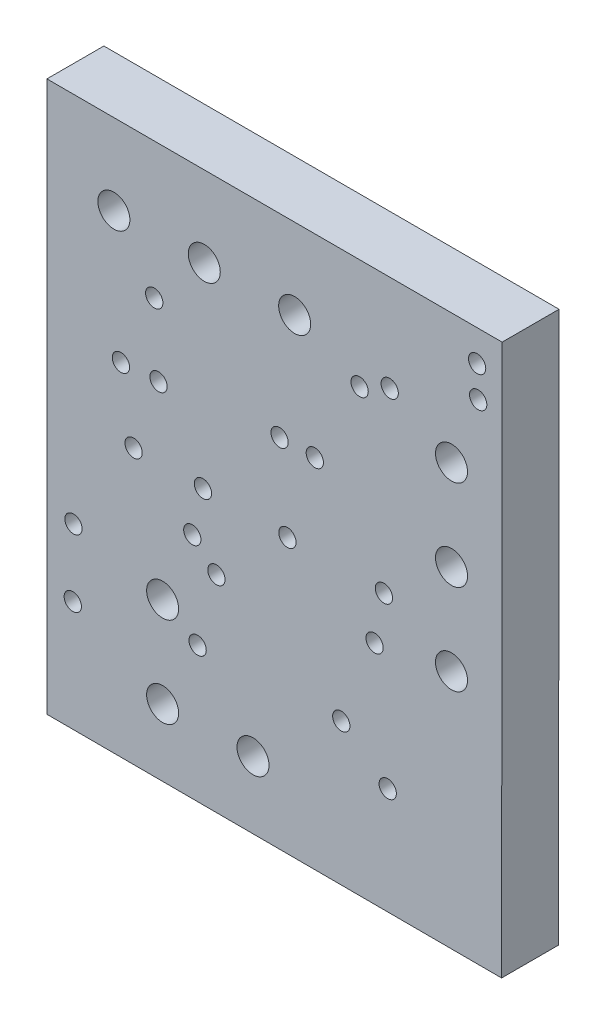
ISO-10303-21;
HEADER;
FILE_DESCRIPTION(('STEP AP214'),'2;1');
FILE_NAME('part.step','',(''),(''),'','','');
FILE_SCHEMA(('AUTOMOTIVE_DESIGN { 1 0 10303 214 1 1 1 1 }'));
ENDSEC;
DATA;
#1=APPLICATION_CONTEXT('core data for automotive mechanical design processes');
#2=APPLICATION_PROTOCOL_DEFINITION('international standard','automotive_design',2000,#1);
#3=PRODUCT_CONTEXT('',#1,'mechanical');
#4=PRODUCT('Part','Part','',(#3));
#5=PRODUCT_RELATED_PRODUCT_CATEGORY('part','',(#4));
#6=PRODUCT_DEFINITION_FORMATION('','',#4);
#7=PRODUCT_DEFINITION_CONTEXT('part definition',#1,'design');
#8=PRODUCT_DEFINITION('design','',#6,#7);
#9=PRODUCT_DEFINITION_SHAPE('','',#8);
#10=(LENGTH_UNIT() NAMED_UNIT(*) SI_UNIT(.MILLI.,.METRE.));
#11=(NAMED_UNIT(*) PLANE_ANGLE_UNIT() SI_UNIT($,.RADIAN.));
#12=(NAMED_UNIT(*) SI_UNIT($,.STERADIAN.) SOLID_ANGLE_UNIT());
#13=UNCERTAINTY_MEASURE_WITH_UNIT(LENGTH_MEASURE(1.E-05),#10,'distance_accuracy_value','');
#14=(GEOMETRIC_REPRESENTATION_CONTEXT(3) GLOBAL_UNCERTAINTY_ASSIGNED_CONTEXT((#13)) GLOBAL_UNIT_ASSIGNED_CONTEXT((#10,
#11,#12)) REPRESENTATION_CONTEXT('',''));
#15=CARTESIAN_POINT('',(0.,0.,0.));
#16=DIRECTION('',(0.,0.,1.));
#17=DIRECTION('',(1.,0.,0.));
#18=AXIS2_PLACEMENT_3D('',#15,#16,#17);
#19=CARTESIAN_POINT('',(67.869100000001,59.307866666665,0.));
#20=DIRECTION('',(0.,0.,-1.));
#21=DIRECTION('',(-1.,0.,0.));
#22=AXIS2_PLACEMENT_3D('',#19,#20,#21);
#23=PLANE('',#22);
#24=CARTESIAN_POINT('',(72.252600000002,51.530333333333,0.));
#25=DIRECTION('',(0.,0.,1.));
#26=DIRECTION('',(1.,0.,0.));
#27=AXIS2_PLACEMENT_3D('',#24,#25,#26);
#28=CIRCLE('',#27,0.243);
#29=CARTESIAN_POINT('',(72.495600000002,51.530333333333,0.));
#30=VERTEX_POINT('',#29);
#31=EDGE_CURVE('E168',#30,#30,#28,.F.);
#32=ORIENTED_EDGE('',*,*,#31,.T.);
#33=EDGE_LOOP('',(#32));
#34=FACE_BOUND('',#33,.T.);
#35=CARTESIAN_POINT('',(77.339000000002,51.527266666667,0.));
#36=DIRECTION('',(0.,0.,1.));
#37=DIRECTION('',(1.,0.,0.));
#38=AXIS2_PLACEMENT_3D('',#35,#36,#37);
#39=CIRCLE('',#38,0.243);
#40=CARTESIAN_POINT('',(77.582000000002,51.527266666667,0.));
#41=VERTEX_POINT('',#40);
#42=EDGE_CURVE('E172',#41,#41,#39,.F.);
#43=ORIENTED_EDGE('',*,*,#42,.T.);
#44=EDGE_LOOP('',(#43));
#45=FACE_BOUND('',#44,.T.);
#46=CARTESIAN_POINT('',(74.406600000002,53.850733333335,0.));
#47=DIRECTION('',(0.,0.,1.));
#48=DIRECTION('',(1.,0.,0.));
#49=AXIS2_PLACEMENT_3D('',#46,#47,#48);
#50=CIRCLE('',#49,0.243);
#51=CARTESIAN_POINT('',(74.649600000002,53.850733333335,0.));
#52=VERTEX_POINT('',#51);
#53=EDGE_CURVE('E175',#52,#52,#50,.F.);
#54=ORIENTED_EDGE('',*,*,#53,.T.);
#55=EDGE_LOOP('',(#54));
#56=FACE_BOUND('',#55,.T.);
#57=CARTESIAN_POINT('',(74.626766666668,51.527266666667,0.));
#58=DIRECTION('',(0.,0.,1.));
#59=DIRECTION('',(1.,0.,0.));
#60=AXIS2_PLACEMENT_3D('',#57,#58,#59);
#61=CIRCLE('',#60,0.243);
#62=CARTESIAN_POINT('',(74.869766666668,51.527266666667,0.));
#63=VERTEX_POINT('',#62);
#64=EDGE_CURVE('E178',#63,#63,#61,.F.);
#65=ORIENTED_EDGE('',*,*,#64,.T.);
#66=EDGE_LOOP('',(#65));
#67=FACE_BOUND('',#66,.T.);
#68=CARTESIAN_POINT('',(77.445200000002,46.822899999999,0.));
#69=DIRECTION('',(0.,0.,1.));
#70=DIRECTION('',(1.,0.,0.));
#71=AXIS2_PLACEMENT_3D('',#68,#69,#70);
#72=CIRCLE('',#71,0.243);
#73=CARTESIAN_POINT('',(77.688200000002,46.822899999999,0.));
#74=VERTEX_POINT('',#73);
#75=EDGE_CURVE('E181',#74,#74,#72,.F.);
#76=ORIENTED_EDGE('',*,*,#75,.T.);
#77=EDGE_LOOP('',(#76));
#78=FACE_BOUND('',#77,.T.);
#79=CARTESIAN_POINT('',(76.140766666669,47.815466666667,0.));
#80=DIRECTION('',(0.,0.,1.));
#81=DIRECTION('',(1.,0.,0.));
#82=AXIS2_PLACEMENT_3D('',#79,#80,#81);
#83=CIRCLE('',#82,0.243);
#84=CARTESIAN_POINT('',(76.383766666669,47.815466666667,0.));
#85=VERTEX_POINT('',#84);
#86=EDGE_CURVE('E184',#85,#85,#83,.F.);
#87=ORIENTED_EDGE('',*,*,#86,.T.);
#88=EDGE_LOOP('',(#87));
#89=FACE_BOUND('',#88,.T.);
#90=CARTESIAN_POINT('',(79.987133333333,57.558466666664,0.));
#91=DIRECTION('',(0.,0.,1.));
#92=DIRECTION('',(1.,0.,0.));
#93=AXIS2_PLACEMENT_3D('',#90,#91,#92);
#94=CIRCLE('',#93,0.243);
#95=CARTESIAN_POINT('',(80.230133333333,57.558466666664,0.));
#96=VERTEX_POINT('',#95);
#97=EDGE_CURVE('E187',#96,#96,#94,.F.);
#98=ORIENTED_EDGE('',*,*,#97,.T.);
#99=EDGE_LOOP('',(#98));
#100=FACE_BOUND('',#99,.T.);
#101=CARTESIAN_POINT('',(76.655699999998,56.210666666666,0.));
#102=DIRECTION('',(0.,0.,1.));
#103=DIRECTION('',(1.,0.,0.));
#104=AXIS2_PLACEMENT_3D('',#101,#102,#103);
#105=CIRCLE('',#104,0.243);
#106=CARTESIAN_POINT('',(76.898699999998,56.210666666666,0.));
#107=VERTEX_POINT('',#106);
#108=EDGE_CURVE('E190',#107,#107,#105,.F.);
#109=ORIENTED_EDGE('',*,*,#108,.T.);
#110=EDGE_LOOP('',(#109));
#111=FACE_BOUND('',#110,.T.);
#112=CARTESIAN_POINT('',(71.954066666668,50.257266666667,0.));
#113=DIRECTION('',(0.,0.,1.));
#114=DIRECTION('',(1.,0.,0.));
#115=AXIS2_PLACEMENT_3D('',#112,#113,#114);
#116=CIRCLE('',#115,0.243);
#117=CARTESIAN_POINT('',(72.197066666668,50.257266666667,0.));
#118=VERTEX_POINT('',#117);
#119=EDGE_CURVE('E193',#118,#118,#116,.F.);
#120=ORIENTED_EDGE('',*,*,#119,.T.);
#121=EDGE_LOOP('',(#120));
#122=FACE_BOUND('',#121,.T.);
#123=CARTESIAN_POINT('',(68.615,48.850733333335,0.));
#124=DIRECTION('',(0.,0.,1.));
#125=DIRECTION('',(1.,0.,0.));
#126=AXIS2_PLACEMENT_3D('',#123,#124,#125);
#127=CIRCLE('',#126,0.243);
#128=CARTESIAN_POINT('',(68.858,48.850733333335,0.));
#129=VERTEX_POINT('',#128);
#130=EDGE_CURVE('E196',#129,#129,#127,.F.);
#131=ORIENTED_EDGE('',*,*,#130,.T.);
#132=EDGE_LOOP('',(#131));
#133=FACE_BOUND('',#132,.T.);
#134=CARTESIAN_POINT('',(71.005299999999,53.507099999998,0.));
#135=DIRECTION('',(0.,0.,1.));
#136=DIRECTION('',(1.,0.,0.));
#137=AXIS2_PLACEMENT_3D('',#134,#135,#136);
#138=CIRCLE('',#137,0.243);
#139=CARTESIAN_POINT('',(71.248299999999,53.507099999998,0.));
#140=VERTEX_POINT('',#139);
#141=EDGE_CURVE('E199',#140,#140,#138,.F.);
#142=ORIENTED_EDGE('',*,*,#141,.T.);
#143=EDGE_LOOP('',(#142));
#144=FACE_BOUND('',#143,.T.);
#145=CARTESIAN_POINT('',(79.238133333332,50.575766666666,0.));
#146=DIRECTION('',(0.,0.,1.));
#147=DIRECTION('',(1.,0.,0.));
#148=AXIS2_PLACEMENT_3D('',#145,#146,#147);
#149=CIRCLE('',#148,0.45);
#150=CARTESIAN_POINT('',(79.688133333332,50.575766666666,0.));
#151=VERTEX_POINT('',#150);
#152=EDGE_CURVE('E202',#151,#151,#149,.F.);
#153=ORIENTED_EDGE('',*,*,#152,.T.);
#154=EDGE_LOOP('',(#153));
#155=FACE_BOUND('',#154,.T.);
#156=CARTESIAN_POINT('',(79.238133333332,53.115766666665,0.));
#157=DIRECTION('',(0.,0.,1.));
#158=DIRECTION('',(1.,0.,0.));
#159=AXIS2_PLACEMENT_3D('',#156,#157,#158);
#160=CIRCLE('',#159,0.45);
#161=CARTESIAN_POINT('',(79.688133333332,53.115766666665,0.));
#162=VERTEX_POINT('',#161);
#163=EDGE_CURVE('E205',#162,#162,#160,.F.);
#164=ORIENTED_EDGE('',*,*,#163,.T.);
#165=EDGE_LOOP('',(#164));
#166=FACE_BOUND('',#165,.T.);
#167=CARTESIAN_POINT('',(79.238133333332,55.655766666663,0.));
#168=DIRECTION('',(0.,0.,1.));
#169=DIRECTION('',(1.,0.,0.));
#170=AXIS2_PLACEMENT_3D('',#167,#168,#169);
#171=CIRCLE('',#170,0.45);
#172=CARTESIAN_POINT('',(79.688133333332,55.655766666663,0.));
#173=VERTEX_POINT('',#172);
#174=EDGE_CURVE('E208',#173,#173,#171,.F.);
#175=ORIENTED_EDGE('',*,*,#174,.T.);
#176=EDGE_LOOP('',(#175));
#177=FACE_BOUND('',#176,.T.);
#178=CARTESIAN_POINT('',(70.8845,55.483800000002,0.));
#179=DIRECTION('',(0.,0.,1.));
#180=DIRECTION('',(1.,0.,0.));
#181=AXIS2_PLACEMENT_3D('',#178,#179,#180);
#182=CIRCLE('',#181,0.243);
#183=CARTESIAN_POINT('',(71.1275,55.483800000002,0.));
#184=VERTEX_POINT('',#183);
#185=EDGE_CURVE('E211',#184,#184,#182,.F.);
#186=ORIENTED_EDGE('',*,*,#185,.T.);
#187=EDGE_LOOP('',(#186));
#188=FACE_BOUND('',#187,.T.);
#189=CARTESIAN_POINT('',(72.103500000002,47.643133333331,0.));
#190=DIRECTION('',(0.,0.,1.));
#191=DIRECTION('',(1.,0.,0.));
#192=AXIS2_PLACEMENT_3D('',#189,#190,#191);
#193=CIRCLE('',#192,0.243);
#194=CARTESIAN_POINT('',(72.346500000002,47.643133333331,0.));
#195=VERTEX_POINT('',#194);
#196=EDGE_CURVE('E214',#195,#195,#193,.F.);
#197=ORIENTED_EDGE('',*,*,#196,.T.);
#198=EDGE_LOOP('',(#197));
#199=FACE_BOUND('',#198,.T.);
#200=CARTESIAN_POINT('',(70.304233333334,51.544133333334,0.));
#201=DIRECTION('',(0.,0.,1.));
#202=DIRECTION('',(1.,0.,0.));
#203=AXIS2_PLACEMENT_3D('',#200,#201,#202);
#204=CIRCLE('',#203,0.243);
#205=CARTESIAN_POINT('',(70.547233333334,51.544133333334,0.));
#206=VERTEX_POINT('',#205);
#207=EDGE_CURVE('E217',#206,#206,#204,.F.);
#208=ORIENTED_EDGE('',*,*,#207,.T.);
#209=EDGE_LOOP('',(#208));
#210=FACE_BOUND('',#209,.T.);
#211=CARTESIAN_POINT('',(77.076433333335,50.184199999998,0.));
#212=DIRECTION('',(0.,0.,1.));
#213=DIRECTION('',(1.,0.,0.));
#214=AXIS2_PLACEMENT_3D('',#211,#212,#213);
#215=CIRCLE('',#214,0.243);
#216=CARTESIAN_POINT('',(77.319433333335,50.184199999998,0.));
#217=VERTEX_POINT('',#216);
#218=EDGE_CURVE('E220',#217,#217,#215,.F.);
#219=ORIENTED_EDGE('',*,*,#218,.T.);
#220=EDGE_LOOP('',(#219));
#221=FACE_BOUND('',#220,.T.);
#222=CARTESIAN_POINT('',(79.957466666664,58.422266666666,0.));
#223=DIRECTION('',(0.,0.,1.));
#224=DIRECTION('',(1.,0.,0.));
#225=AXIS2_PLACEMENT_3D('',#222,#223,#224);
#226=CIRCLE('',#225,0.243);
#227=CARTESIAN_POINT('',(80.200466666664,58.422266666666,0.));
#228=VERTEX_POINT('',#227);
#229=EDGE_CURVE('E223',#228,#228,#226,.F.);
#230=ORIENTED_EDGE('',*,*,#229,.T.);
#231=EDGE_LOOP('',(#230));
#232=FACE_BOUND('',#231,.T.);
#233=CARTESIAN_POINT('',(69.948333333334,53.4474,0.));
#234=DIRECTION('',(0.,0.,1.));
#235=DIRECTION('',(1.,0.,0.));
#236=AXIS2_PLACEMENT_3D('',#233,#234,#235);
#237=CIRCLE('',#236,0.243);
#238=CARTESIAN_POINT('',(70.191333333334,53.4474,0.));
#239=VERTEX_POINT('',#238);
#240=EDGE_CURVE('E226',#239,#239,#237,.F.);
#241=ORIENTED_EDGE('',*,*,#240,.T.);
#242=EDGE_LOOP('',(#241));
#243=FACE_BOUND('',#242,.T.);
#244=CARTESIAN_POINT('',(77.500733333334,56.593533333333,0.));
#245=DIRECTION('',(0.,0.,1.));
#246=DIRECTION('',(1.,0.,0.));
#247=AXIS2_PLACEMENT_3D('',#244,#245,#246);
#248=CIRCLE('',#247,0.243);
#249=CARTESIAN_POINT('',(77.743733333334,56.593533333333,0.));
#250=VERTEX_POINT('',#249);
#251=EDGE_CURVE('E229',#250,#250,#248,.F.);
#252=ORIENTED_EDGE('',*,*,#251,.T.);
#253=EDGE_LOOP('',(#252));
#254=FACE_BOUND('',#253,.T.);
#255=CARTESIAN_POINT('',(72.631366666668,49.621566666669,0.));
#256=DIRECTION('',(0.,0.,1.));
#257=DIRECTION('',(1.,0.,0.));
#258=AXIS2_PLACEMENT_3D('',#255,#256,#257);
#259=CIRCLE('',#258,0.243);
#260=CARTESIAN_POINT('',(72.874366666668,49.621566666669,0.));
#261=VERTEX_POINT('',#260);
#262=EDGE_CURVE('E232',#261,#261,#259,.F.);
#263=ORIENTED_EDGE('',*,*,#262,.T.);
#264=EDGE_LOOP('',(#263));
#265=FACE_BOUND('',#264,.T.);
#266=CARTESIAN_POINT('',(68.595133333331,46.952033333335,0.));
#267=DIRECTION('',(0.,0.,1.));
#268=DIRECTION('',(1.,0.,0.));
#269=AXIS2_PLACEMENT_3D('',#266,#267,#268);
#270=CIRCLE('',#269,0.243);
#271=CARTESIAN_POINT('',(68.838133333331,46.952033333335,0.));
#272=VERTEX_POINT('',#271);
#273=EDGE_CURVE('E235',#272,#272,#270,.F.);
#274=ORIENTED_EDGE('',*,*,#273,.T.);
#275=EDGE_LOOP('',(#274));
#276=FACE_BOUND('',#275,.T.);
#277=CARTESIAN_POINT('',(75.396666666667,53.853833333332,0.));
#278=DIRECTION('',(0.,0.,1.));
#279=DIRECTION('',(1.,0.,0.));
#280=AXIS2_PLACEMENT_3D('',#277,#278,#279);
#281=CIRCLE('',#280,0.243);
#282=CARTESIAN_POINT('',(75.639666666667,53.853833333332,0.));
#283=VERTEX_POINT('',#282);
#284=EDGE_CURVE('E238',#283,#283,#281,.F.);
#285=ORIENTED_EDGE('',*,*,#284,.T.);
#286=EDGE_LOOP('',(#285));
#287=FACE_BOUND('',#286,.T.);
#288=CARTESIAN_POINT('',(73.659999999999,45.720000000001,0.));
#289=DIRECTION('',(0.,0.,1.));
#290=DIRECTION('',(1.,0.,0.));
#291=AXIS2_PLACEMENT_3D('',#288,#289,#290);
#292=CIRCLE('',#291,0.45);
#293=CARTESIAN_POINT('',(74.109999999999,45.720000000001,0.));
#294=VERTEX_POINT('',#293);
#295=EDGE_CURVE('E241',#294,#294,#292,.F.);
#296=ORIENTED_EDGE('',*,*,#295,.T.);
#297=EDGE_LOOP('',(#296));
#298=FACE_BOUND('',#297,.T.);
#299=CARTESIAN_POINT('',(71.12,48.26,0.));
#300=DIRECTION('',(0.,0.,1.));
#301=DIRECTION('',(1.,0.,0.));
#302=AXIS2_PLACEMENT_3D('',#299,#300,#301);
#303=CIRCLE('',#302,0.45);
#304=CARTESIAN_POINT('',(71.57,48.26,0.));
#305=VERTEX_POINT('',#304);
#306=EDGE_CURVE('E244',#305,#305,#303,.F.);
#307=ORIENTED_EDGE('',*,*,#306,.T.);
#308=EDGE_LOOP('',(#307));
#309=FACE_BOUND('',#308,.T.);
#310=CARTESIAN_POINT('',(71.12,45.720000000001,0.));
#311=DIRECTION('',(0.,0.,1.));
#312=DIRECTION('',(1.,0.,0.));
#313=AXIS2_PLACEMENT_3D('',#310,#311,#312);
#314=CIRCLE('',#313,0.45);
#315=CARTESIAN_POINT('',(71.57,45.720000000001,0.));
#316=VERTEX_POINT('',#315);
#317=EDGE_CURVE('E247',#316,#316,#314,.F.);
#318=ORIENTED_EDGE('',*,*,#317,.T.);
#319=EDGE_LOOP('',(#318));
#320=FACE_BOUND('',#319,.T.);
#321=CARTESIAN_POINT('',(74.830266666667,57.041966666666,0.));
#322=DIRECTION('',(0.,0.,1.));
#323=DIRECTION('',(1.,0.,0.));
#324=AXIS2_PLACEMENT_3D('',#321,#322,#323);
#325=CIRCLE('',#324,0.45);
#326=CARTESIAN_POINT('',(75.280266666667,57.041966666666,0.));
#327=VERTEX_POINT('',#326);
#328=EDGE_CURVE('E250',#327,#327,#325,.F.);
#329=ORIENTED_EDGE('',*,*,#328,.T.);
#330=EDGE_LOOP('',(#329));
#331=FACE_BOUND('',#330,.T.);
#332=CARTESIAN_POINT('',(72.290266666668,57.041966666666,0.));
#333=DIRECTION('',(0.,0.,1.));
#334=DIRECTION('',(1.,0.,0.));
#335=AXIS2_PLACEMENT_3D('',#332,#333,#334);
#336=CIRCLE('',#335,0.45);
#337=CARTESIAN_POINT('',(72.740266666668,57.041966666666,0.));
#338=VERTEX_POINT('',#337);
#339=EDGE_CURVE('E252',#338,#338,#336,.F.);
#340=ORIENTED_EDGE('',*,*,#339,.T.);
#341=EDGE_LOOP('',(#340));
#342=FACE_BOUND('',#341,.T.);
#343=CARTESIAN_POINT('',(69.75026666667,57.041966666666,0.));
#344=DIRECTION('',(0.,0.,1.));
#345=DIRECTION('',(1.,0.,0.));
#346=AXIS2_PLACEMENT_3D('',#343,#344,#345);
#347=CIRCLE('',#346,0.45);
#348=CARTESIAN_POINT('',(70.20026666667,57.041966666666,0.));
#349=VERTEX_POINT('',#348);
#350=EDGE_CURVE('E20',#349,#349,#347,.F.);
#351=ORIENTED_EDGE('',*,*,#350,.T.);
#352=EDGE_LOOP('',(#351));
#353=FACE_BOUND('',#352,.T.);
#354=DIRECTION('',(0.999997363538509,-0.00229628309018287,0.));
#355=VECTOR('',#354,1.);
#356=CARTESIAN_POINT('',(67.870766666664,43.844333333332,0.));
#357=LINE('',#356,#355);
#358=CARTESIAN_POINT('',(80.644999999999,43.8150000000021,0.));
#359=VERTEX_POINT('',#358);
#360=CARTESIAN_POINT('',(67.8707666666641,43.844333333332,0.));
#361=VERTEX_POINT('',#360);
#362=EDGE_CURVE('E70',#359,#361,#357,.F.);
#363=ORIENTED_EDGE('',*,*,#362,.F.);
#364=DIRECTION('',(0.000981780598217507,0.999999518053312,0.));
#365=VECTOR('',#364,1.);
#366=CARTESIAN_POINT('',(80.644999999999,43.815000000002,0.));
#367=LINE('',#366,#365);
#368=CARTESIAN_POINT('',(80.6601999999981,59.297066666666,0.));
#369=VERTEX_POINT('',#368);
#370=EDGE_CURVE('E55',#369,#359,#367,.F.);
#371=ORIENTED_EDGE('',*,*,#370,.F.);
#372=DIRECTION('',(-0.99999964354764,0.000844336777064896,0.));
#373=VECTOR('',#372,1.);
#374=CARTESIAN_POINT('',(80.660199999998,59.297066666666,0.));
#375=LINE('',#374,#373);
#376=CARTESIAN_POINT('',(67.869100000001,59.3078666666649,0.));
#377=VERTEX_POINT('',#376);
#378=EDGE_CURVE('E60',#377,#369,#375,.F.);
#379=ORIENTED_EDGE('',*,*,#378,.F.);
#380=DIRECTION('',(0.000107780454683966,-0.999999994191687,0.));
#381=VECTOR('',#380,1.);
#382=CARTESIAN_POINT('',(67.869100000001,59.307866666665,0.));
#383=LINE('',#382,#381);
#384=EDGE_CURVE('E257',#361,#377,#383,.F.);
#385=ORIENTED_EDGE('',*,*,#384,.F.);
#386=EDGE_LOOP('',(#363,#371,#379,#385));
#387=FACE_BOUND('',#386,.T.);
#388=ADVANCED_FACE('F17',(#34,#45,#56,#67,#78,#89,#100,#111,#122,#133,#144,#155,#166,#177,#188,
#199,#210,#221,#232,#243,#254,#265,#276,#287,#298,#309,#320,#331,#342,#353,#387),#23,.F.);
#389=CARTESIAN_POINT('',(80.660199999998,59.297066666666,0.));
#390=DIRECTION('',(0.000844336777064896,0.99999964354764,0.));
#391=DIRECTION('',(-0.99999964354764,0.000844336777064896,0.));
#392=AXIS2_PLACEMENT_3D('',#389,#390,#391);
#393=PLANE('',#392);
#394=DIRECTION('',(0.,0.,1.));
#395=VECTOR('',#394,1.);
#396=CARTESIAN_POINT('',(67.869100000001,59.307866666665,0.));
#397=LINE('',#396,#395);
#398=CARTESIAN_POINT('',(67.869100000001,59.3078666666649,-1.6));
#399=VERTEX_POINT('',#398);
#400=EDGE_CURVE('E65',#377,#399,#397,.F.);
#401=ORIENTED_EDGE('',*,*,#400,.F.);
#402=ORIENTED_EDGE('',*,*,#378,.T.);
#403=DIRECTION('',(0.,0.,1.));
#404=VECTOR('',#403,1.);
#405=CARTESIAN_POINT('',(80.6601999999982,59.297066666666,0.));
#406=LINE('',#405,#404);
#407=CARTESIAN_POINT('',(80.6601999999981,59.297066666666,-1.6));
#408=VERTEX_POINT('',#407);
#409=EDGE_CURVE('E62',#408,#369,#406,.T.);
#410=ORIENTED_EDGE('',*,*,#409,.F.);
#411=DIRECTION('',(0.99999964354764,-0.000844336777080638,0.));
#412=VECTOR('',#411,1.);
#413=CARTESIAN_POINT('',(67.869100000001,59.307866666665,-1.6));
#414=LINE('',#413,#412);
#415=EDGE_CURVE('E171',#399,#408,#414,.T.);
#416=ORIENTED_EDGE('',*,*,#415,.F.);
#417=EDGE_LOOP('',(#401,#402,#410,#416));
#418=FACE_BOUND('',#417,.T.);
#419=ADVANCED_FACE('F61',(#418),#393,.T.);
#420=CARTESIAN_POINT('',(80.644999999999,43.815000000002,0.));
#421=DIRECTION('',(0.999999518053312,-0.000981780598217507,0.));
#422=DIRECTION('',(0.000981780598217507,0.999999518053312,0.));
#423=AXIS2_PLACEMENT_3D('',#420,#421,#422);
#424=PLANE('',#423);
#425=ORIENTED_EDGE('',*,*,#409,.T.);
#426=ORIENTED_EDGE('',*,*,#370,.T.);
#427=DIRECTION('',(0.,0.,1.));
#428=VECTOR('',#427,1.);
#429=CARTESIAN_POINT('',(80.644999999999,43.8150000000024,0.));
#430=LINE('',#429,#428);
#431=CARTESIAN_POINT('',(80.644999999999,43.8150000000021,-1.6));
#432=VERTEX_POINT('',#431);
#433=EDGE_CURVE('E72',#432,#359,#430,.T.);
#434=ORIENTED_EDGE('',*,*,#433,.F.);
#435=DIRECTION('',(-0.000981780598202227,-0.999999518053312,0.));
#436=VECTOR('',#435,1.);
#437=CARTESIAN_POINT('',(80.660199999998,59.297066666666,-1.6));
#438=LINE('',#437,#436);
#439=EDGE_CURVE('E76',#408,#432,#438,.T.);
#440=ORIENTED_EDGE('',*,*,#439,.F.);
#441=EDGE_LOOP('',(#425,#426,#434,#440));
#442=FACE_BOUND('',#441,.T.);
#443=ADVANCED_FACE('F74',(#442),#424,.T.);
#444=CARTESIAN_POINT('',(67.870766666664,43.844333333332,0.));
#445=DIRECTION('',(-0.00229628309018287,-0.999997363538509,0.));
#446=DIRECTION('',(0.999997363538509,-0.00229628309018287,0.));
#447=AXIS2_PLACEMENT_3D('',#444,#445,#446);
#448=PLANE('',#447);
#449=ORIENTED_EDGE('',*,*,#433,.T.);
#450=ORIENTED_EDGE('',*,*,#362,.T.);
#451=DIRECTION('',(0.,0.,1.));
#452=VECTOR('',#451,1.);
#453=CARTESIAN_POINT('',(67.8707666666644,43.844333333332,0.));
#454=LINE('',#453,#452);
#455=CARTESIAN_POINT('',(67.8707666666641,43.844333333332,-1.6));
#456=VERTEX_POINT('',#455);
#457=EDGE_CURVE('E35',#456,#361,#454,.T.);
#458=ORIENTED_EDGE('',*,*,#457,.F.);
#459=DIRECTION('',(-0.999997363538509,0.00229628309021448,0.));
#460=VECTOR('',#459,1.);
#461=CARTESIAN_POINT('',(80.644999999999,43.815000000002,-1.6));
#462=LINE('',#461,#460);
#463=EDGE_CURVE('E269',#432,#456,#462,.T.);
#464=ORIENTED_EDGE('',*,*,#463,.F.);
#465=EDGE_LOOP('',(#449,#450,#458,#464));
#466=FACE_BOUND('',#465,.T.);
#467=ADVANCED_FACE('F267',(#466),#448,.T.);
#468=CARTESIAN_POINT('',(67.869100000001,59.307866666665,0.));
#469=DIRECTION('',(-0.999999994191687,-0.000107780454683966,0.));
#470=DIRECTION('',(0.000107780454683966,-0.999999994191687,0.));
#471=AXIS2_PLACEMENT_3D('',#468,#469,#470);
#472=PLANE('',#471);
#473=ORIENTED_EDGE('',*,*,#457,.T.);
#474=ORIENTED_EDGE('',*,*,#384,.T.);
#475=ORIENTED_EDGE('',*,*,#400,.T.);
#476=DIRECTION('',(-0.000107780454660178,0.999999994191687,0.));
#477=VECTOR('',#476,1.);
#478=CARTESIAN_POINT('',(67.870766666664,43.844333333332,-1.6));
#479=LINE('',#478,#477);
#480=EDGE_CURVE('E167',#456,#399,#479,.T.);
#481=ORIENTED_EDGE('',*,*,#480,.F.);
#482=EDGE_LOOP('',(#473,#474,#475,#481));
#483=FACE_BOUND('',#482,.T.);
#484=ADVANCED_FACE('F275',(#483),#472,.T.);
#485=CARTESIAN_POINT('',(69.75026666667,57.041966666666,0.));
#486=DIRECTION('',(0.,0.,1.));
#487=DIRECTION('',(1.,0.,0.));
#488=AXIS2_PLACEMENT_3D('',#485,#486,#487);
#489=CYLINDRICAL_SURFACE('',#488,0.45);
#490=CARTESIAN_POINT('',(69.75026666667,57.041966666666,-1.6));
#491=DIRECTION('',(0.,0.,1.));
#492=DIRECTION('',(1.,0.,0.));
#493=AXIS2_PLACEMENT_3D('',#490,#491,#492);
#494=CIRCLE('',#493,0.45);
#495=CARTESIAN_POINT('',(70.20026666667,57.041966666666,-1.6));
#496=VERTEX_POINT('',#495);
#497=EDGE_CURVE('E164',#496,#496,#494,.T.);
#498=ORIENTED_EDGE('',*,*,#497,.F.);
#499=EDGE_LOOP('',(#498));
#500=FACE_BOUND('',#499,.T.);
#501=ORIENTED_EDGE('',*,*,#350,.F.);
#502=EDGE_LOOP('',(#501));
#503=FACE_BOUND('',#502,.T.);
#504=ADVANCED_FACE('F277',(#500,#503),#489,.F.);
#505=CARTESIAN_POINT('',(72.290266666668,57.041966666666,0.));
#506=DIRECTION('',(0.,0.,1.));
#507=DIRECTION('',(1.,0.,0.));
#508=AXIS2_PLACEMENT_3D('',#505,#506,#507);
#509=CYLINDRICAL_SURFACE('',#508,0.45);
#510=CARTESIAN_POINT('',(72.290266666668,57.041966666666,-1.6));
#511=DIRECTION('',(0.,0.,1.));
#512=DIRECTION('',(1.,0.,0.));
#513=AXIS2_PLACEMENT_3D('',#510,#511,#512);
#514=CIRCLE('',#513,0.45);
#515=CARTESIAN_POINT('',(72.740266666668,57.041966666666,-1.6));
#516=VERTEX_POINT('',#515);
#517=EDGE_CURVE('E161',#516,#516,#514,.T.);
#518=ORIENTED_EDGE('',*,*,#517,.F.);
#519=EDGE_LOOP('',(#518));
#520=FACE_BOUND('',#519,.T.);
#521=ORIENTED_EDGE('',*,*,#339,.F.);
#522=EDGE_LOOP('',(#521));
#523=FACE_BOUND('',#522,.T.);
#524=ADVANCED_FACE('F284',(#520,#523),#509,.F.);
#525=CARTESIAN_POINT('',(74.830266666667,57.041966666666,0.));
#526=DIRECTION('',(0.,0.,1.));
#527=DIRECTION('',(1.,0.,0.));
#528=AXIS2_PLACEMENT_3D('',#525,#526,#527);
#529=CYLINDRICAL_SURFACE('',#528,0.45);
#530=CARTESIAN_POINT('',(74.830266666667,57.041966666666,-1.6));
#531=DIRECTION('',(0.,0.,1.));
#532=DIRECTION('',(1.,0.,0.));
#533=AXIS2_PLACEMENT_3D('',#530,#531,#532);
#534=CIRCLE('',#533,0.45);
#535=CARTESIAN_POINT('',(75.280266666667,57.041966666666,-1.6));
#536=VERTEX_POINT('',#535);
#537=EDGE_CURVE('E158',#536,#536,#534,.T.);
#538=ORIENTED_EDGE('',*,*,#537,.F.);
#539=EDGE_LOOP('',(#538));
#540=FACE_BOUND('',#539,.T.);
#541=ORIENTED_EDGE('',*,*,#328,.F.);
#542=EDGE_LOOP('',(#541));
#543=FACE_BOUND('',#542,.T.);
#544=ADVANCED_FACE('F402',(#540,#543),#529,.F.);
#545=CARTESIAN_POINT('',(71.12,45.720000000001,0.));
#546=DIRECTION('',(0.,0.,1.));
#547=DIRECTION('',(1.,0.,0.));
#548=AXIS2_PLACEMENT_3D('',#545,#546,#547);
#549=CYLINDRICAL_SURFACE('',#548,0.45);
#550=CARTESIAN_POINT('',(71.12,45.720000000001,-1.6));
#551=DIRECTION('',(0.,0.,1.));
#552=DIRECTION('',(1.,0.,0.));
#553=AXIS2_PLACEMENT_3D('',#550,#551,#552);
#554=CIRCLE('',#553,0.45);
#555=CARTESIAN_POINT('',(71.57,45.720000000001,-1.6));
#556=VERTEX_POINT('',#555);
#557=EDGE_CURVE('E155',#556,#556,#554,.T.);
#558=ORIENTED_EDGE('',*,*,#557,.F.);
#559=EDGE_LOOP('',(#558));
#560=FACE_BOUND('',#559,.T.);
#561=ORIENTED_EDGE('',*,*,#317,.F.);
#562=EDGE_LOOP('',(#561));
#563=FACE_BOUND('',#562,.T.);
#564=ADVANCED_FACE('F398',(#560,#563),#549,.F.);
#565=CARTESIAN_POINT('',(71.12,48.26,0.));
#566=DIRECTION('',(0.,0.,1.));
#567=DIRECTION('',(1.,0.,0.));
#568=AXIS2_PLACEMENT_3D('',#565,#566,#567);
#569=CYLINDRICAL_SURFACE('',#568,0.45);
#570=CARTESIAN_POINT('',(71.12,48.26,-1.6));
#571=DIRECTION('',(0.,0.,1.));
#572=DIRECTION('',(1.,0.,0.));
#573=AXIS2_PLACEMENT_3D('',#570,#571,#572);
#574=CIRCLE('',#573,0.45);
#575=CARTESIAN_POINT('',(71.57,48.26,-1.6));
#576=VERTEX_POINT('',#575);
#577=EDGE_CURVE('E152',#576,#576,#574,.T.);
#578=ORIENTED_EDGE('',*,*,#577,.F.);
#579=EDGE_LOOP('',(#578));
#580=FACE_BOUND('',#579,.T.);
#581=ORIENTED_EDGE('',*,*,#306,.F.);
#582=EDGE_LOOP('',(#581));
#583=FACE_BOUND('',#582,.T.);
#584=ADVANCED_FACE('F394',(#580,#583),#569,.F.);
#585=CARTESIAN_POINT('',(73.659999999999,45.720000000001,0.));
#586=DIRECTION('',(0.,0.,1.));
#587=DIRECTION('',(1.,0.,0.));
#588=AXIS2_PLACEMENT_3D('',#585,#586,#587);
#589=CYLINDRICAL_SURFACE('',#588,0.45);
#590=CARTESIAN_POINT('',(73.659999999999,45.720000000001,-1.6));
#591=DIRECTION('',(0.,0.,1.));
#592=DIRECTION('',(1.,0.,0.));
#593=AXIS2_PLACEMENT_3D('',#590,#591,#592);
#594=CIRCLE('',#593,0.45);
#595=CARTESIAN_POINT('',(74.109999999999,45.720000000001,-1.6));
#596=VERTEX_POINT('',#595);
#597=EDGE_CURVE('E149',#596,#596,#594,.T.);
#598=ORIENTED_EDGE('',*,*,#597,.F.);
#599=EDGE_LOOP('',(#598));
#600=FACE_BOUND('',#599,.T.);
#601=ORIENTED_EDGE('',*,*,#295,.F.);
#602=EDGE_LOOP('',(#601));
#603=FACE_BOUND('',#602,.T.);
#604=ADVANCED_FACE('F390',(#600,#603),#589,.F.);
#605=CARTESIAN_POINT('',(75.396666666667,53.853833333332,0.));
#606=DIRECTION('',(0.,0.,1.));
#607=DIRECTION('',(1.,0.,0.));
#608=AXIS2_PLACEMENT_3D('',#605,#606,#607);
#609=CYLINDRICAL_SURFACE('',#608,0.243);
#610=CARTESIAN_POINT('',(75.396666666667,53.853833333332,-1.6));
#611=DIRECTION('',(0.,0.,1.));
#612=DIRECTION('',(1.,0.,0.));
#613=AXIS2_PLACEMENT_3D('',#610,#611,#612);
#614=CIRCLE('',#613,0.243);
#615=CARTESIAN_POINT('',(75.639666666667,53.853833333332,-1.6));
#616=VERTEX_POINT('',#615);
#617=EDGE_CURVE('E146',#616,#616,#614,.T.);
#618=ORIENTED_EDGE('',*,*,#617,.F.);
#619=EDGE_LOOP('',(#618));
#620=FACE_BOUND('',#619,.T.);
#621=ORIENTED_EDGE('',*,*,#284,.F.);
#622=EDGE_LOOP('',(#621));
#623=FACE_BOUND('',#622,.T.);
#624=ADVANCED_FACE('F386',(#620,#623),#609,.F.);
#625=CARTESIAN_POINT('',(68.595133333331,46.952033333335,0.));
#626=DIRECTION('',(0.,0.,1.));
#627=DIRECTION('',(1.,0.,0.));
#628=AXIS2_PLACEMENT_3D('',#625,#626,#627);
#629=CYLINDRICAL_SURFACE('',#628,0.243);
#630=CARTESIAN_POINT('',(68.595133333331,46.952033333335,-1.6));
#631=DIRECTION('',(0.,0.,1.));
#632=DIRECTION('',(1.,0.,0.));
#633=AXIS2_PLACEMENT_3D('',#630,#631,#632);
#634=CIRCLE('',#633,0.243);
#635=CARTESIAN_POINT('',(68.838133333331,46.952033333335,-1.6));
#636=VERTEX_POINT('',#635);
#637=EDGE_CURVE('E143',#636,#636,#634,.T.);
#638=ORIENTED_EDGE('',*,*,#637,.F.);
#639=EDGE_LOOP('',(#638));
#640=FACE_BOUND('',#639,.T.);
#641=ORIENTED_EDGE('',*,*,#273,.F.);
#642=EDGE_LOOP('',(#641));
#643=FACE_BOUND('',#642,.T.);
#644=ADVANCED_FACE('F382',(#640,#643),#629,.F.);
#645=CARTESIAN_POINT('',(72.631366666668,49.621566666669,0.));
#646=DIRECTION('',(0.,0.,1.));
#647=DIRECTION('',(1.,0.,0.));
#648=AXIS2_PLACEMENT_3D('',#645,#646,#647);
#649=CYLINDRICAL_SURFACE('',#648,0.243);
#650=CARTESIAN_POINT('',(72.631366666668,49.621566666669,-1.6));
#651=DIRECTION('',(0.,0.,1.));
#652=DIRECTION('',(1.,0.,0.));
#653=AXIS2_PLACEMENT_3D('',#650,#651,#652);
#654=CIRCLE('',#653,0.243);
#655=CARTESIAN_POINT('',(72.874366666668,49.621566666669,-1.6));
#656=VERTEX_POINT('',#655);
#657=EDGE_CURVE('E140',#656,#656,#654,.T.);
#658=ORIENTED_EDGE('',*,*,#657,.F.);
#659=EDGE_LOOP('',(#658));
#660=FACE_BOUND('',#659,.T.);
#661=ORIENTED_EDGE('',*,*,#262,.F.);
#662=EDGE_LOOP('',(#661));
#663=FACE_BOUND('',#662,.T.);
#664=ADVANCED_FACE('F378',(#660,#663),#649,.F.);
#665=CARTESIAN_POINT('',(77.500733333334,56.593533333333,0.));
#666=DIRECTION('',(0.,0.,1.));
#667=DIRECTION('',(1.,0.,0.));
#668=AXIS2_PLACEMENT_3D('',#665,#666,#667);
#669=CYLINDRICAL_SURFACE('',#668,0.243);
#670=CARTESIAN_POINT('',(77.500733333334,56.593533333333,-1.6));
#671=DIRECTION('',(0.,0.,1.));
#672=DIRECTION('',(1.,0.,0.));
#673=AXIS2_PLACEMENT_3D('',#670,#671,#672);
#674=CIRCLE('',#673,0.243);
#675=CARTESIAN_POINT('',(77.743733333334,56.593533333333,-1.6));
#676=VERTEX_POINT('',#675);
#677=EDGE_CURVE('E137',#676,#676,#674,.T.);
#678=ORIENTED_EDGE('',*,*,#677,.F.);
#679=EDGE_LOOP('',(#678));
#680=FACE_BOUND('',#679,.T.);
#681=ORIENTED_EDGE('',*,*,#251,.F.);
#682=EDGE_LOOP('',(#681));
#683=FACE_BOUND('',#682,.T.);
#684=ADVANCED_FACE('F374',(#680,#683),#669,.F.);
#685=CARTESIAN_POINT('',(69.948333333334,53.4474,0.));
#686=DIRECTION('',(0.,0.,1.));
#687=DIRECTION('',(1.,0.,0.));
#688=AXIS2_PLACEMENT_3D('',#685,#686,#687);
#689=CYLINDRICAL_SURFACE('',#688,0.243);
#690=CARTESIAN_POINT('',(69.948333333334,53.4474,-1.6));
#691=DIRECTION('',(0.,0.,1.));
#692=DIRECTION('',(1.,0.,0.));
#693=AXIS2_PLACEMENT_3D('',#690,#691,#692);
#694=CIRCLE('',#693,0.243);
#695=CARTESIAN_POINT('',(70.191333333334,53.4474,-1.6));
#696=VERTEX_POINT('',#695);
#697=EDGE_CURVE('E134',#696,#696,#694,.T.);
#698=ORIENTED_EDGE('',*,*,#697,.F.);
#699=EDGE_LOOP('',(#698));
#700=FACE_BOUND('',#699,.T.);
#701=ORIENTED_EDGE('',*,*,#240,.F.);
#702=EDGE_LOOP('',(#701));
#703=FACE_BOUND('',#702,.T.);
#704=ADVANCED_FACE('F370',(#700,#703),#689,.F.);
#705=CARTESIAN_POINT('',(79.957466666664,58.422266666666,0.));
#706=DIRECTION('',(0.,0.,1.));
#707=DIRECTION('',(1.,0.,0.));
#708=AXIS2_PLACEMENT_3D('',#705,#706,#707);
#709=CYLINDRICAL_SURFACE('',#708,0.243);
#710=CARTESIAN_POINT('',(79.957466666664,58.422266666666,-1.6));
#711=DIRECTION('',(0.,0.,1.));
#712=DIRECTION('',(1.,0.,0.));
#713=AXIS2_PLACEMENT_3D('',#710,#711,#712);
#714=CIRCLE('',#713,0.243);
#715=CARTESIAN_POINT('',(80.200466666664,58.422266666666,-1.6));
#716=VERTEX_POINT('',#715);
#717=EDGE_CURVE('E131',#716,#716,#714,.T.);
#718=ORIENTED_EDGE('',*,*,#717,.F.);
#719=EDGE_LOOP('',(#718));
#720=FACE_BOUND('',#719,.T.);
#721=ORIENTED_EDGE('',*,*,#229,.F.);
#722=EDGE_LOOP('',(#721));
#723=FACE_BOUND('',#722,.T.);
#724=ADVANCED_FACE('F366',(#720,#723),#709,.F.);
#725=CARTESIAN_POINT('',(77.076433333335,50.184199999998,0.));
#726=DIRECTION('',(0.,0.,1.));
#727=DIRECTION('',(1.,0.,0.));
#728=AXIS2_PLACEMENT_3D('',#725,#726,#727);
#729=CYLINDRICAL_SURFACE('',#728,0.243);
#730=CARTESIAN_POINT('',(77.076433333335,50.184199999998,-1.6));
#731=DIRECTION('',(0.,0.,1.));
#732=DIRECTION('',(1.,0.,0.));
#733=AXIS2_PLACEMENT_3D('',#730,#731,#732);
#734=CIRCLE('',#733,0.243);
#735=CARTESIAN_POINT('',(77.319433333335,50.184199999998,-1.6));
#736=VERTEX_POINT('',#735);
#737=EDGE_CURVE('E128',#736,#736,#734,.T.);
#738=ORIENTED_EDGE('',*,*,#737,.F.);
#739=EDGE_LOOP('',(#738));
#740=FACE_BOUND('',#739,.T.);
#741=ORIENTED_EDGE('',*,*,#218,.F.);
#742=EDGE_LOOP('',(#741));
#743=FACE_BOUND('',#742,.T.);
#744=ADVANCED_FACE('F362',(#740,#743),#729,.F.);
#745=CARTESIAN_POINT('',(70.304233333334,51.544133333334,0.));
#746=DIRECTION('',(0.,0.,1.));
#747=DIRECTION('',(1.,0.,0.));
#748=AXIS2_PLACEMENT_3D('',#745,#746,#747);
#749=CYLINDRICAL_SURFACE('',#748,0.243);
#750=CARTESIAN_POINT('',(70.304233333334,51.544133333334,-1.6));
#751=DIRECTION('',(0.,0.,1.));
#752=DIRECTION('',(1.,0.,0.));
#753=AXIS2_PLACEMENT_3D('',#750,#751,#752);
#754=CIRCLE('',#753,0.243);
#755=CARTESIAN_POINT('',(70.547233333334,51.544133333334,-1.6));
#756=VERTEX_POINT('',#755);
#757=EDGE_CURVE('E125',#756,#756,#754,.T.);
#758=ORIENTED_EDGE('',*,*,#757,.F.);
#759=EDGE_LOOP('',(#758));
#760=FACE_BOUND('',#759,.T.);
#761=ORIENTED_EDGE('',*,*,#207,.F.);
#762=EDGE_LOOP('',(#761));
#763=FACE_BOUND('',#762,.T.);
#764=ADVANCED_FACE('F358',(#760,#763),#749,.F.);
#765=CARTESIAN_POINT('',(72.103500000002,47.643133333331,0.));
#766=DIRECTION('',(0.,0.,1.));
#767=DIRECTION('',(1.,0.,0.));
#768=AXIS2_PLACEMENT_3D('',#765,#766,#767);
#769=CYLINDRICAL_SURFACE('',#768,0.243);
#770=CARTESIAN_POINT('',(72.103500000002,47.643133333331,-1.6));
#771=DIRECTION('',(0.,0.,1.));
#772=DIRECTION('',(1.,0.,0.));
#773=AXIS2_PLACEMENT_3D('',#770,#771,#772);
#774=CIRCLE('',#773,0.243);
#775=CARTESIAN_POINT('',(72.346500000002,47.643133333331,-1.6));
#776=VERTEX_POINT('',#775);
#777=EDGE_CURVE('E122',#776,#776,#774,.T.);
#778=ORIENTED_EDGE('',*,*,#777,.F.);
#779=EDGE_LOOP('',(#778));
#780=FACE_BOUND('',#779,.T.);
#781=ORIENTED_EDGE('',*,*,#196,.F.);
#782=EDGE_LOOP('',(#781));
#783=FACE_BOUND('',#782,.T.);
#784=ADVANCED_FACE('F354',(#780,#783),#769,.F.);
#785=CARTESIAN_POINT('',(70.8845,55.483800000002,0.));
#786=DIRECTION('',(0.,0.,1.));
#787=DIRECTION('',(1.,0.,0.));
#788=AXIS2_PLACEMENT_3D('',#785,#786,#787);
#789=CYLINDRICAL_SURFACE('',#788,0.243);
#790=CARTESIAN_POINT('',(70.8845,55.483800000002,-1.6));
#791=DIRECTION('',(0.,0.,1.));
#792=DIRECTION('',(1.,0.,0.));
#793=AXIS2_PLACEMENT_3D('',#790,#791,#792);
#794=CIRCLE('',#793,0.243);
#795=CARTESIAN_POINT('',(71.1275,55.483800000002,-1.6));
#796=VERTEX_POINT('',#795);
#797=EDGE_CURVE('E119',#796,#796,#794,.T.);
#798=ORIENTED_EDGE('',*,*,#797,.F.);
#799=EDGE_LOOP('',(#798));
#800=FACE_BOUND('',#799,.T.);
#801=ORIENTED_EDGE('',*,*,#185,.F.);
#802=EDGE_LOOP('',(#801));
#803=FACE_BOUND('',#802,.T.);
#804=ADVANCED_FACE('F350',(#800,#803),#789,.F.);
#805=CARTESIAN_POINT('',(79.238133333332,55.655766666663,0.));
#806=DIRECTION('',(0.,0.,1.));
#807=DIRECTION('',(1.,0.,0.));
#808=AXIS2_PLACEMENT_3D('',#805,#806,#807);
#809=CYLINDRICAL_SURFACE('',#808,0.45);
#810=CARTESIAN_POINT('',(79.238133333332,55.655766666663,-1.6));
#811=DIRECTION('',(0.,0.,1.));
#812=DIRECTION('',(1.,0.,0.));
#813=AXIS2_PLACEMENT_3D('',#810,#811,#812);
#814=CIRCLE('',#813,0.45);
#815=CARTESIAN_POINT('',(79.688133333332,55.655766666663,-1.6));
#816=VERTEX_POINT('',#815);
#817=EDGE_CURVE('E116',#816,#816,#814,.T.);
#818=ORIENTED_EDGE('',*,*,#817,.F.);
#819=EDGE_LOOP('',(#818));
#820=FACE_BOUND('',#819,.T.);
#821=ORIENTED_EDGE('',*,*,#174,.F.);
#822=EDGE_LOOP('',(#821));
#823=FACE_BOUND('',#822,.T.);
#824=ADVANCED_FACE('F346',(#820,#823),#809,.F.);
#825=CARTESIAN_POINT('',(79.238133333332,53.115766666665,0.));
#826=DIRECTION('',(0.,0.,1.));
#827=DIRECTION('',(1.,0.,0.));
#828=AXIS2_PLACEMENT_3D('',#825,#826,#827);
#829=CYLINDRICAL_SURFACE('',#828,0.45);
#830=CARTESIAN_POINT('',(79.238133333332,53.115766666665,-1.6));
#831=DIRECTION('',(0.,0.,1.));
#832=DIRECTION('',(1.,0.,0.));
#833=AXIS2_PLACEMENT_3D('',#830,#831,#832);
#834=CIRCLE('',#833,0.45);
#835=CARTESIAN_POINT('',(79.688133333332,53.115766666665,-1.6));
#836=VERTEX_POINT('',#835);
#837=EDGE_CURVE('E113',#836,#836,#834,.T.);
#838=ORIENTED_EDGE('',*,*,#837,.F.);
#839=EDGE_LOOP('',(#838));
#840=FACE_BOUND('',#839,.T.);
#841=ORIENTED_EDGE('',*,*,#163,.F.);
#842=EDGE_LOOP('',(#841));
#843=FACE_BOUND('',#842,.T.);
#844=ADVANCED_FACE('F342',(#840,#843),#829,.F.);
#845=CARTESIAN_POINT('',(79.238133333332,50.575766666666,0.));
#846=DIRECTION('',(0.,0.,1.));
#847=DIRECTION('',(1.,0.,0.));
#848=AXIS2_PLACEMENT_3D('',#845,#846,#847);
#849=CYLINDRICAL_SURFACE('',#848,0.45);
#850=CARTESIAN_POINT('',(79.238133333332,50.575766666666,-1.6));
#851=DIRECTION('',(0.,0.,1.));
#852=DIRECTION('',(1.,0.,0.));
#853=AXIS2_PLACEMENT_3D('',#850,#851,#852);
#854=CIRCLE('',#853,0.45);
#855=CARTESIAN_POINT('',(79.688133333332,50.575766666666,-1.6));
#856=VERTEX_POINT('',#855);
#857=EDGE_CURVE('E110',#856,#856,#854,.T.);
#858=ORIENTED_EDGE('',*,*,#857,.F.);
#859=EDGE_LOOP('',(#858));
#860=FACE_BOUND('',#859,.T.);
#861=ORIENTED_EDGE('',*,*,#152,.F.);
#862=EDGE_LOOP('',(#861));
#863=FACE_BOUND('',#862,.T.);
#864=ADVANCED_FACE('F338',(#860,#863),#849,.F.);
#865=CARTESIAN_POINT('',(71.005299999999,53.507099999998,0.));
#866=DIRECTION('',(0.,0.,1.));
#867=DIRECTION('',(1.,0.,0.));
#868=AXIS2_PLACEMENT_3D('',#865,#866,#867);
#869=CYLINDRICAL_SURFACE('',#868,0.243);
#870=CARTESIAN_POINT('',(71.005299999999,53.507099999998,-1.6));
#871=DIRECTION('',(0.,0.,1.));
#872=DIRECTION('',(1.,0.,0.));
#873=AXIS2_PLACEMENT_3D('',#870,#871,#872);
#874=CIRCLE('',#873,0.243);
#875=CARTESIAN_POINT('',(71.248299999999,53.507099999998,-1.6));
#876=VERTEX_POINT('',#875);
#877=EDGE_CURVE('E107',#876,#876,#874,.T.);
#878=ORIENTED_EDGE('',*,*,#877,.F.);
#879=EDGE_LOOP('',(#878));
#880=FACE_BOUND('',#879,.T.);
#881=ORIENTED_EDGE('',*,*,#141,.F.);
#882=EDGE_LOOP('',(#881));
#883=FACE_BOUND('',#882,.T.);
#884=ADVANCED_FACE('F334',(#880,#883),#869,.F.);
#885=CARTESIAN_POINT('',(68.615,48.850733333335,0.));
#886=DIRECTION('',(0.,0.,1.));
#887=DIRECTION('',(1.,0.,0.));
#888=AXIS2_PLACEMENT_3D('',#885,#886,#887);
#889=CYLINDRICAL_SURFACE('',#888,0.243);
#890=CARTESIAN_POINT('',(68.615,48.850733333335,-1.6));
#891=DIRECTION('',(0.,0.,1.));
#892=DIRECTION('',(1.,0.,0.));
#893=AXIS2_PLACEMENT_3D('',#890,#891,#892);
#894=CIRCLE('',#893,0.243);
#895=CARTESIAN_POINT('',(68.858,48.850733333335,-1.6));
#896=VERTEX_POINT('',#895);
#897=EDGE_CURVE('E104',#896,#896,#894,.T.);
#898=ORIENTED_EDGE('',*,*,#897,.F.);
#899=EDGE_LOOP('',(#898));
#900=FACE_BOUND('',#899,.T.);
#901=ORIENTED_EDGE('',*,*,#130,.F.);
#902=EDGE_LOOP('',(#901));
#903=FACE_BOUND('',#902,.T.);
#904=ADVANCED_FACE('F330',(#900,#903),#889,.F.);
#905=CARTESIAN_POINT('',(71.954066666668,50.257266666667,0.));
#906=DIRECTION('',(0.,0.,1.));
#907=DIRECTION('',(1.,0.,0.));
#908=AXIS2_PLACEMENT_3D('',#905,#906,#907);
#909=CYLINDRICAL_SURFACE('',#908,0.243);
#910=CARTESIAN_POINT('',(71.954066666668,50.257266666667,-1.6));
#911=DIRECTION('',(0.,0.,1.));
#912=DIRECTION('',(1.,0.,0.));
#913=AXIS2_PLACEMENT_3D('',#910,#911,#912);
#914=CIRCLE('',#913,0.243);
#915=CARTESIAN_POINT('',(72.197066666668,50.257266666667,-1.6));
#916=VERTEX_POINT('',#915);
#917=EDGE_CURVE('E101',#916,#916,#914,.T.);
#918=ORIENTED_EDGE('',*,*,#917,.F.);
#919=EDGE_LOOP('',(#918));
#920=FACE_BOUND('',#919,.T.);
#921=ORIENTED_EDGE('',*,*,#119,.F.);
#922=EDGE_LOOP('',(#921));
#923=FACE_BOUND('',#922,.T.);
#924=ADVANCED_FACE('F326',(#920,#923),#909,.F.);
#925=CARTESIAN_POINT('',(76.655699999998,56.210666666666,0.));
#926=DIRECTION('',(0.,0.,1.));
#927=DIRECTION('',(1.,0.,0.));
#928=AXIS2_PLACEMENT_3D('',#925,#926,#927);
#929=CYLINDRICAL_SURFACE('',#928,0.243);
#930=CARTESIAN_POINT('',(76.655699999998,56.210666666666,-1.6));
#931=DIRECTION('',(0.,0.,1.));
#932=DIRECTION('',(1.,0.,0.));
#933=AXIS2_PLACEMENT_3D('',#930,#931,#932);
#934=CIRCLE('',#933,0.243);
#935=CARTESIAN_POINT('',(76.898699999998,56.210666666666,-1.6));
#936=VERTEX_POINT('',#935);
#937=EDGE_CURVE('E98',#936,#936,#934,.T.);
#938=ORIENTED_EDGE('',*,*,#937,.F.);
#939=EDGE_LOOP('',(#938));
#940=FACE_BOUND('',#939,.T.);
#941=ORIENTED_EDGE('',*,*,#108,.F.);
#942=EDGE_LOOP('',(#941));
#943=FACE_BOUND('',#942,.T.);
#944=ADVANCED_FACE('F322',(#940,#943),#929,.F.);
#945=CARTESIAN_POINT('',(79.987133333333,57.558466666664,0.));
#946=DIRECTION('',(0.,0.,1.));
#947=DIRECTION('',(1.,0.,0.));
#948=AXIS2_PLACEMENT_3D('',#945,#946,#947);
#949=CYLINDRICAL_SURFACE('',#948,0.243);
#950=CARTESIAN_POINT('',(79.987133333333,57.558466666664,-1.6));
#951=DIRECTION('',(0.,0.,1.));
#952=DIRECTION('',(1.,0.,0.));
#953=AXIS2_PLACEMENT_3D('',#950,#951,#952);
#954=CIRCLE('',#953,0.243);
#955=CARTESIAN_POINT('',(80.230133333333,57.558466666664,-1.6));
#956=VERTEX_POINT('',#955);
#957=EDGE_CURVE('E95',#956,#956,#954,.T.);
#958=ORIENTED_EDGE('',*,*,#957,.F.);
#959=EDGE_LOOP('',(#958));
#960=FACE_BOUND('',#959,.T.);
#961=ORIENTED_EDGE('',*,*,#97,.F.);
#962=EDGE_LOOP('',(#961));
#963=FACE_BOUND('',#962,.T.);
#964=ADVANCED_FACE('F318',(#960,#963),#949,.F.);
#965=CARTESIAN_POINT('',(76.140766666669,47.815466666667,0.));
#966=DIRECTION('',(0.,0.,1.));
#967=DIRECTION('',(1.,0.,0.));
#968=AXIS2_PLACEMENT_3D('',#965,#966,#967);
#969=CYLINDRICAL_SURFACE('',#968,0.243);
#970=CARTESIAN_POINT('',(76.140766666669,47.815466666667,-1.6));
#971=DIRECTION('',(0.,0.,1.));
#972=DIRECTION('',(1.,0.,0.));
#973=AXIS2_PLACEMENT_3D('',#970,#971,#972);
#974=CIRCLE('',#973,0.243);
#975=CARTESIAN_POINT('',(76.383766666669,47.815466666667,-1.6));
#976=VERTEX_POINT('',#975);
#977=EDGE_CURVE('E92',#976,#976,#974,.T.);
#978=ORIENTED_EDGE('',*,*,#977,.F.);
#979=EDGE_LOOP('',(#978));
#980=FACE_BOUND('',#979,.T.);
#981=ORIENTED_EDGE('',*,*,#86,.F.);
#982=EDGE_LOOP('',(#981));
#983=FACE_BOUND('',#982,.T.);
#984=ADVANCED_FACE('F314',(#980,#983),#969,.F.);
#985=CARTESIAN_POINT('',(77.445200000002,46.822899999999,0.));
#986=DIRECTION('',(0.,0.,1.));
#987=DIRECTION('',(1.,0.,0.));
#988=AXIS2_PLACEMENT_3D('',#985,#986,#987);
#989=CYLINDRICAL_SURFACE('',#988,0.243);
#990=CARTESIAN_POINT('',(77.445200000002,46.822899999999,-1.6));
#991=DIRECTION('',(0.,0.,1.));
#992=DIRECTION('',(1.,0.,0.));
#993=AXIS2_PLACEMENT_3D('',#990,#991,#992);
#994=CIRCLE('',#993,0.243);
#995=CARTESIAN_POINT('',(77.688200000002,46.822899999999,-1.6));
#996=VERTEX_POINT('',#995);
#997=EDGE_CURVE('E89',#996,#996,#994,.T.);
#998=ORIENTED_EDGE('',*,*,#997,.F.);
#999=EDGE_LOOP('',(#998));
#1000=FACE_BOUND('',#999,.T.);
#1001=ORIENTED_EDGE('',*,*,#75,.F.);
#1002=EDGE_LOOP('',(#1001));
#1003=FACE_BOUND('',#1002,.T.);
#1004=ADVANCED_FACE('F310',(#1000,#1003),#989,.F.);
#1005=CARTESIAN_POINT('',(74.626766666668,51.527266666667,0.));
#1006=DIRECTION('',(0.,0.,1.));
#1007=DIRECTION('',(1.,0.,0.));
#1008=AXIS2_PLACEMENT_3D('',#1005,#1006,#1007);
#1009=CYLINDRICAL_SURFACE('',#1008,0.243);
#1010=CARTESIAN_POINT('',(74.626766666668,51.527266666667,-1.6));
#1011=DIRECTION('',(0.,0.,1.));
#1012=DIRECTION('',(1.,0.,0.));
#1013=AXIS2_PLACEMENT_3D('',#1010,#1011,#1012);
#1014=CIRCLE('',#1013,0.243);
#1015=CARTESIAN_POINT('',(74.869766666668,51.527266666667,-1.6));
#1016=VERTEX_POINT('',#1015);
#1017=EDGE_CURVE('E86',#1016,#1016,#1014,.T.);
#1018=ORIENTED_EDGE('',*,*,#1017,.F.);
#1019=EDGE_LOOP('',(#1018));
#1020=FACE_BOUND('',#1019,.T.);
#1021=ORIENTED_EDGE('',*,*,#64,.F.);
#1022=EDGE_LOOP('',(#1021));
#1023=FACE_BOUND('',#1022,.T.);
#1024=ADVANCED_FACE('F306',(#1020,#1023),#1009,.F.);
#1025=CARTESIAN_POINT('',(74.406600000002,53.850733333335,0.));
#1026=DIRECTION('',(0.,0.,1.));
#1027=DIRECTION('',(1.,0.,0.));
#1028=AXIS2_PLACEMENT_3D('',#1025,#1026,#1027);
#1029=CYLINDRICAL_SURFACE('',#1028,0.243);
#1030=CARTESIAN_POINT('',(74.406600000002,53.850733333335,-1.6));
#1031=DIRECTION('',(0.,0.,1.));
#1032=DIRECTION('',(1.,0.,0.));
#1033=AXIS2_PLACEMENT_3D('',#1030,#1031,#1032);
#1034=CIRCLE('',#1033,0.243);
#1035=CARTESIAN_POINT('',(74.649600000002,53.850733333335,-1.6));
#1036=VERTEX_POINT('',#1035);
#1037=EDGE_CURVE('E83',#1036,#1036,#1034,.T.);
#1038=ORIENTED_EDGE('',*,*,#1037,.F.);
#1039=EDGE_LOOP('',(#1038));
#1040=FACE_BOUND('',#1039,.T.);
#1041=ORIENTED_EDGE('',*,*,#53,.F.);
#1042=EDGE_LOOP('',(#1041));
#1043=FACE_BOUND('',#1042,.T.);
#1044=ADVANCED_FACE('F302',(#1040,#1043),#1029,.F.);
#1045=CARTESIAN_POINT('',(77.339000000002,51.527266666667,0.));
#1046=DIRECTION('',(0.,0.,1.));
#1047=DIRECTION('',(1.,0.,0.));
#1048=AXIS2_PLACEMENT_3D('',#1045,#1046,#1047);
#1049=CYLINDRICAL_SURFACE('',#1048,0.243);
#1050=CARTESIAN_POINT('',(77.339000000002,51.527266666667,-1.6));
#1051=DIRECTION('',(0.,0.,1.));
#1052=DIRECTION('',(1.,0.,0.));
#1053=AXIS2_PLACEMENT_3D('',#1050,#1051,#1052);
#1054=CIRCLE('',#1053,0.243);
#1055=CARTESIAN_POINT('',(77.582000000002,51.527266666667,-1.6));
#1056=VERTEX_POINT('',#1055);
#1057=EDGE_CURVE('E26',#1056,#1056,#1054,.T.);
#1058=ORIENTED_EDGE('',*,*,#1057,.F.);
#1059=EDGE_LOOP('',(#1058));
#1060=FACE_BOUND('',#1059,.T.);
#1061=ORIENTED_EDGE('',*,*,#42,.F.);
#1062=EDGE_LOOP('',(#1061));
#1063=FACE_BOUND('',#1062,.T.);
#1064=ADVANCED_FACE('F295',(#1060,#1063),#1049,.F.);
#1065=CARTESIAN_POINT('',(72.252600000002,51.530333333333,0.));
#1066=DIRECTION('',(0.,0.,1.));
#1067=DIRECTION('',(1.,0.,0.));
#1068=AXIS2_PLACEMENT_3D('',#1065,#1066,#1067);
#1069=CYLINDRICAL_SURFACE('',#1068,0.243);
#1070=CARTESIAN_POINT('',(72.252600000002,51.530333333333,-1.6));
#1071=DIRECTION('',(0.,0.,1.));
#1072=DIRECTION('',(1.,0.,0.));
#1073=AXIS2_PLACEMENT_3D('',#1070,#1071,#1072);
#1074=CIRCLE('',#1073,0.243);
#1075=CARTESIAN_POINT('',(72.495600000002,51.530333333333,-1.6));
#1076=VERTEX_POINT('',#1075);
#1077=EDGE_CURVE('E11',#1076,#1076,#1074,.T.);
#1078=ORIENTED_EDGE('',*,*,#1077,.F.);
#1079=EDGE_LOOP('',(#1078));
#1080=FACE_BOUND('',#1079,.T.);
#1081=ORIENTED_EDGE('',*,*,#31,.F.);
#1082=EDGE_LOOP('',(#1081));
#1083=FACE_BOUND('',#1082,.T.);
#1084=ADVANCED_FACE('F289',(#1080,#1083),#1069,.F.);
#1085=CARTESIAN_POINT('',(67.869100000001,59.307866666665,-1.6));
#1086=DIRECTION('',(0.,0.,-1.));
#1087=DIRECTION('',(-1.,0.,0.));
#1088=AXIS2_PLACEMENT_3D('',#1085,#1086,#1087);
#1089=PLANE('',#1088);
#1090=ORIENTED_EDGE('',*,*,#1077,.T.);
#1091=EDGE_LOOP('',(#1090));
#1092=FACE_BOUND('',#1091,.T.);
#1093=ORIENTED_EDGE('',*,*,#1057,.T.);
#1094=EDGE_LOOP('',(#1093));
#1095=FACE_BOUND('',#1094,.T.);
#1096=ORIENTED_EDGE('',*,*,#1037,.T.);
#1097=EDGE_LOOP('',(#1096));
#1098=FACE_BOUND('',#1097,.T.);
#1099=ORIENTED_EDGE('',*,*,#1017,.T.);
#1100=EDGE_LOOP('',(#1099));
#1101=FACE_BOUND('',#1100,.T.);
#1102=ORIENTED_EDGE('',*,*,#997,.T.);
#1103=EDGE_LOOP('',(#1102));
#1104=FACE_BOUND('',#1103,.T.);
#1105=ORIENTED_EDGE('',*,*,#977,.T.);
#1106=EDGE_LOOP('',(#1105));
#1107=FACE_BOUND('',#1106,.T.);
#1108=ORIENTED_EDGE('',*,*,#957,.T.);
#1109=EDGE_LOOP('',(#1108));
#1110=FACE_BOUND('',#1109,.T.);
#1111=ORIENTED_EDGE('',*,*,#937,.T.);
#1112=EDGE_LOOP('',(#1111));
#1113=FACE_BOUND('',#1112,.T.);
#1114=ORIENTED_EDGE('',*,*,#917,.T.);
#1115=EDGE_LOOP('',(#1114));
#1116=FACE_BOUND('',#1115,.T.);
#1117=ORIENTED_EDGE('',*,*,#897,.T.);
#1118=EDGE_LOOP('',(#1117));
#1119=FACE_BOUND('',#1118,.T.);
#1120=ORIENTED_EDGE('',*,*,#877,.T.);
#1121=EDGE_LOOP('',(#1120));
#1122=FACE_BOUND('',#1121,.T.);
#1123=ORIENTED_EDGE('',*,*,#857,.T.);
#1124=EDGE_LOOP('',(#1123));
#1125=FACE_BOUND('',#1124,.T.);
#1126=ORIENTED_EDGE('',*,*,#837,.T.);
#1127=EDGE_LOOP('',(#1126));
#1128=FACE_BOUND('',#1127,.T.);
#1129=ORIENTED_EDGE('',*,*,#817,.T.);
#1130=EDGE_LOOP('',(#1129));
#1131=FACE_BOUND('',#1130,.T.);
#1132=ORIENTED_EDGE('',*,*,#797,.T.);
#1133=EDGE_LOOP('',(#1132));
#1134=FACE_BOUND('',#1133,.T.);
#1135=ORIENTED_EDGE('',*,*,#777,.T.);
#1136=EDGE_LOOP('',(#1135));
#1137=FACE_BOUND('',#1136,.T.);
#1138=ORIENTED_EDGE('',*,*,#757,.T.);
#1139=EDGE_LOOP('',(#1138));
#1140=FACE_BOUND('',#1139,.T.);
#1141=ORIENTED_EDGE('',*,*,#737,.T.);
#1142=EDGE_LOOP('',(#1141));
#1143=FACE_BOUND('',#1142,.T.);
#1144=ORIENTED_EDGE('',*,*,#717,.T.);
#1145=EDGE_LOOP('',(#1144));
#1146=FACE_BOUND('',#1145,.T.);
#1147=ORIENTED_EDGE('',*,*,#697,.T.);
#1148=EDGE_LOOP('',(#1147));
#1149=FACE_BOUND('',#1148,.T.);
#1150=ORIENTED_EDGE('',*,*,#677,.T.);
#1151=EDGE_LOOP('',(#1150));
#1152=FACE_BOUND('',#1151,.T.);
#1153=ORIENTED_EDGE('',*,*,#657,.T.);
#1154=EDGE_LOOP('',(#1153));
#1155=FACE_BOUND('',#1154,.T.);
#1156=ORIENTED_EDGE('',*,*,#637,.T.);
#1157=EDGE_LOOP('',(#1156));
#1158=FACE_BOUND('',#1157,.T.);
#1159=ORIENTED_EDGE('',*,*,#617,.T.);
#1160=EDGE_LOOP('',(#1159));
#1161=FACE_BOUND('',#1160,.T.);
#1162=ORIENTED_EDGE('',*,*,#597,.T.);
#1163=EDGE_LOOP('',(#1162));
#1164=FACE_BOUND('',#1163,.T.);
#1165=ORIENTED_EDGE('',*,*,#577,.T.);
#1166=EDGE_LOOP('',(#1165));
#1167=FACE_BOUND('',#1166,.T.);
#1168=ORIENTED_EDGE('',*,*,#557,.T.);
#1169=EDGE_LOOP('',(#1168));
#1170=FACE_BOUND('',#1169,.T.);
#1171=ORIENTED_EDGE('',*,*,#537,.T.);
#1172=EDGE_LOOP('',(#1171));
#1173=FACE_BOUND('',#1172,.T.);
#1174=ORIENTED_EDGE('',*,*,#517,.T.);
#1175=EDGE_LOOP('',(#1174));
#1176=FACE_BOUND('',#1175,.T.);
#1177=ORIENTED_EDGE('',*,*,#497,.T.);
#1178=EDGE_LOOP('',(#1177));
#1179=FACE_BOUND('',#1178,.T.);
#1180=ORIENTED_EDGE('',*,*,#463,.T.);
#1181=ORIENTED_EDGE('',*,*,#480,.T.);
#1182=ORIENTED_EDGE('',*,*,#415,.T.);
#1183=ORIENTED_EDGE('',*,*,#439,.T.);
#1184=EDGE_LOOP('',(#1180,#1181,#1182,#1183));
#1185=FACE_BOUND('',#1184,.T.);
#1186=ADVANCED_FACE('F273',(#1092,#1095,#1098,#1101,#1104,#1107,#1110,#1113,#1116,#1119,#1122,
#1125,#1128,#1131,#1134,#1137,#1140,#1143,#1146,#1149,#1152,#1155,#1158,#1161,#1164,#1167,#1170,
#1173,#1176,#1179,#1185),#1089,.T.);
#1187=CLOSED_SHELL('',(#388,#419,#443,#467,#484,#504,#524,#544,#564,#584,#604,#624,#644,#664,
#684,#704,#724,#744,#764,#784,#804,#824,#844,#864,#884,#904,#924,#944,#964,#984,#1004,#1024,
#1044,#1064,#1084,#1186));
#1188=MANIFOLD_SOLID_BREP('B1',#1187);
#1189=ADVANCED_BREP_SHAPE_REPRESENTATION('',(#18,#1188),#14);
#1190=SHAPE_DEFINITION_REPRESENTATION(#9,#1189);
ENDSEC;
END-ISO-10303-21;
